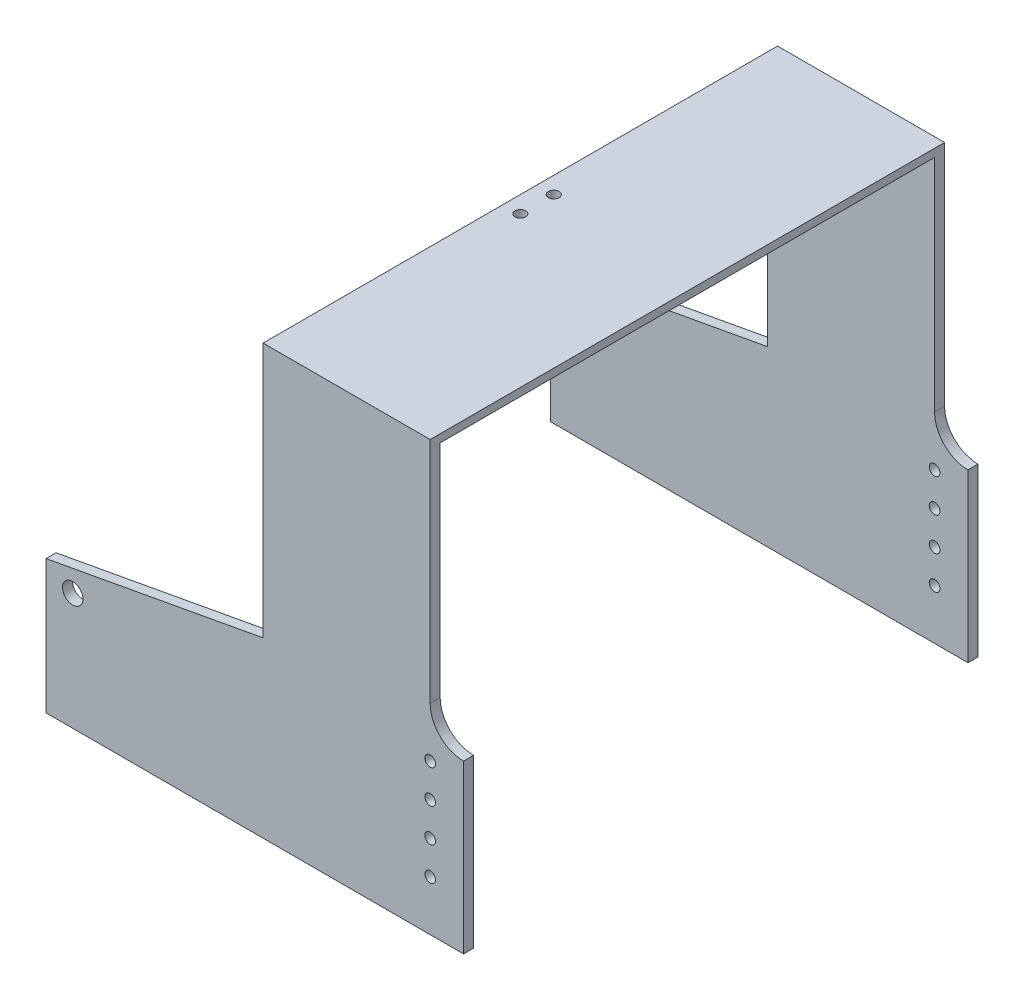
ISO-10303-21;
HEADER;
FILE_DESCRIPTION(('STEP AP214'),'2;1');
FILE_NAME('part.step','',(''),(''),'','','');
FILE_SCHEMA(('AUTOMOTIVE_DESIGN { 1 0 10303 214 1 1 1 1 }'));
ENDSEC;
DATA;
#1=APPLICATION_CONTEXT('core data for automotive mechanical design processes');
#2=APPLICATION_PROTOCOL_DEFINITION('international standard','automotive_design',2000,#1);
#3=PRODUCT_CONTEXT('',#1,'mechanical');
#4=PRODUCT('Part','Part','',(#3));
#5=PRODUCT_RELATED_PRODUCT_CATEGORY('part','',(#4));
#6=PRODUCT_DEFINITION_FORMATION('','',#4);
#7=PRODUCT_DEFINITION_CONTEXT('part definition',#1,'design');
#8=PRODUCT_DEFINITION('design','',#6,#7);
#9=PRODUCT_DEFINITION_SHAPE('','',#8);
#10=(LENGTH_UNIT() NAMED_UNIT(*) SI_UNIT(.MILLI.,.METRE.));
#11=(NAMED_UNIT(*) PLANE_ANGLE_UNIT() SI_UNIT($,.RADIAN.));
#12=(NAMED_UNIT(*) SI_UNIT($,.STERADIAN.) SOLID_ANGLE_UNIT());
#13=UNCERTAINTY_MEASURE_WITH_UNIT(LENGTH_MEASURE(1.E-05),#10,'distance_accuracy_value','');
#14=(GEOMETRIC_REPRESENTATION_CONTEXT(3) GLOBAL_UNCERTAINTY_ASSIGNED_CONTEXT((#13)) GLOBAL_UNIT_ASSIGNED_CONTEXT((#10,
#11,#12)) REPRESENTATION_CONTEXT('',''));
#15=CARTESIAN_POINT('',(0.,0.,0.));
#16=DIRECTION('',(0.,0.,1.));
#17=DIRECTION('',(1.,0.,0.));
#18=AXIS2_PLACEMENT_3D('',#15,#16,#17);
#19=CARTESIAN_POINT('',(-121.707383513561,14.5764027473865,154.));
#20=DIRECTION('',(0.180649896804306,-0.983547464428938,0.));
#21=DIRECTION('',(0.983547464428938,0.180649896804306,0.));
#22=AXIS2_PLACEMENT_3D('',#19,#20,#21);
#23=PLANE('',#22);
#24=DIRECTION('',(0.,0.,-1.));
#25=VECTOR('',#24,1.);
#26=CARTESIAN_POINT('',(-56.7073835135608,26.5150673436066,154.));
#27=LINE('',#26,#25);
#28=CARTESIAN_POINT('',(-56.7073835135608,26.5150673436066,154.));
#29=VERTEX_POINT('',#28);
#30=CARTESIAN_POINT('',(-56.7073835135608,26.5150673436066,151.));
#31=VERTEX_POINT('',#30);
#32=EDGE_CURVE('E191',#29,#31,#27,.T.);
#33=ORIENTED_EDGE('',*,*,#32,.T.);
#34=DIRECTION('',(-0.983547464428938,-0.180649896804306,0.));
#35=VECTOR('',#34,1.);
#36=CARTESIAN_POINT('',(-121.707383513561,14.5764027473865,151.));
#37=LINE('',#36,#35);
#38=CARTESIAN_POINT('',(-121.707383513561,14.5764027473865,151.));
#39=VERTEX_POINT('',#38);
#40=EDGE_CURVE('E312',#31,#39,#37,.T.);
#41=ORIENTED_EDGE('',*,*,#40,.T.);
#42=DIRECTION('',(0.,0.,-1.));
#43=VECTOR('',#42,1.);
#44=CARTESIAN_POINT('',(-121.707383513561,14.5764027473865,154.));
#45=LINE('',#44,#43);
#46=CARTESIAN_POINT('',(-121.707383513561,14.5764027473865,154.));
#47=VERTEX_POINT('',#46);
#48=EDGE_CURVE('E187',#47,#39,#45,.T.);
#49=ORIENTED_EDGE('',*,*,#48,.F.);
#50=DIRECTION('',(-0.983547464428938,-0.180649896804306,0.));
#51=VECTOR('',#50,1.);
#52=CARTESIAN_POINT('',(-121.707383513561,14.5764027473865,154.));
#53=LINE('',#52,#51);
#54=EDGE_CURVE('E269',#29,#47,#53,.T.);
#55=ORIENTED_EDGE('',*,*,#54,.F.);
#56=EDGE_LOOP('',(#33,#41,#49,#55));
#57=FACE_BOUND('',#56,.T.);
#58=ADVANCED_FACE('F40',(#57),#23,.F.);
#59=CARTESIAN_POINT('',(-121.707383513561,-25.4235972526135,154.));
#60=DIRECTION('',(1.,0.,0.));
#61=DIRECTION('',(0.,0.,-1.));
#62=AXIS2_PLACEMENT_3D('',#59,#60,#61);
#63=PLANE('',#62);
#64=ORIENTED_EDGE('',*,*,#48,.T.);
#65=DIRECTION('',(0.,-1.,0.));
#66=VECTOR('',#65,1.);
#67=CARTESIAN_POINT('',(-121.707383513561,100.576402747386,151.));
#68=LINE('',#67,#66);
#69=CARTESIAN_POINT('',(-121.707383513561,-25.4235972526135,151.));
#70=VERTEX_POINT('',#69);
#71=EDGE_CURVE('E205',#39,#70,#68,.T.);
#72=ORIENTED_EDGE('',*,*,#71,.T.);
#73=DIRECTION('',(0.,0.,-1.));
#74=VECTOR('',#73,1.);
#75=CARTESIAN_POINT('',(-121.707383513561,-25.4235972526135,154.));
#76=LINE('',#75,#74);
#77=CARTESIAN_POINT('',(-121.707383513561,-25.4235972526135,154.));
#78=VERTEX_POINT('',#77);
#79=EDGE_CURVE('E178',#78,#70,#76,.T.);
#80=ORIENTED_EDGE('',*,*,#79,.F.);
#81=DIRECTION('',(0.,-1.,0.));
#82=VECTOR('',#81,1.);
#83=CARTESIAN_POINT('',(-121.707383513561,-25.4235972526135,154.));
#84=LINE('',#83,#82);
#85=EDGE_CURVE('E267',#47,#78,#84,.T.);
#86=ORIENTED_EDGE('',*,*,#85,.F.);
#87=EDGE_LOOP('',(#64,#72,#80,#86));
#88=FACE_BOUND('',#87,.T.);
#89=ADVANCED_FACE('F398',(#88),#63,.F.);
#90=CARTESIAN_POINT('',(3.29261648643917,-25.4235972526135,154.));
#91=DIRECTION('',(0.,1.,0.));
#92=DIRECTION('',(-1.,0.,0.));
#93=AXIS2_PLACEMENT_3D('',#90,#91,#92);
#94=PLANE('',#93);
#95=ORIENTED_EDGE('',*,*,#79,.T.);
#96=DIRECTION('',(-1.,0.,0.));
#97=VECTOR('',#96,1.);
#98=CARTESIAN_POINT('',(-121.707383513561,-25.4235972526135,151.));
#99=LINE('',#98,#97);
#100=CARTESIAN_POINT('',(3.29261648643917,-25.4235972526135,151.));
#101=VERTEX_POINT('',#100);
#102=EDGE_CURVE('E171',#101,#70,#99,.T.);
#103=ORIENTED_EDGE('',*,*,#102,.F.);
#104=DIRECTION('',(0.,0.,-1.));
#105=VECTOR('',#104,1.);
#106=CARTESIAN_POINT('',(3.29261648643917,-25.4235972526135,154.));
#107=LINE('',#106,#105);
#108=CARTESIAN_POINT('',(3.29261648643917,-25.4235972526135,154.));
#109=VERTEX_POINT('',#108);
#110=EDGE_CURVE('E179',#109,#101,#107,.T.);
#111=ORIENTED_EDGE('',*,*,#110,.F.);
#112=DIRECTION('',(1.,0.,0.));
#113=VECTOR('',#112,1.);
#114=CARTESIAN_POINT('',(3.29261648643917,-25.4235972526135,154.));
#115=LINE('',#114,#113);
#116=EDGE_CURVE('E265',#78,#109,#115,.T.);
#117=ORIENTED_EDGE('',*,*,#116,.F.);
#118=EDGE_LOOP('',(#95,#103,#111,#117));
#119=FACE_BOUND('',#118,.T.);
#120=ADVANCED_FACE('F401',(#119),#94,.F.);
#121=CARTESIAN_POINT('',(3.29261648643917,24.5764027473865,154.));
#122=DIRECTION('',(-1.,0.,0.));
#123=DIRECTION('',(0.,-1.,0.));
#124=AXIS2_PLACEMENT_3D('',#121,#122,#123);
#125=PLANE('',#124);
#126=ORIENTED_EDGE('',*,*,#110,.T.);
#127=DIRECTION('',(0.,-1.,0.));
#128=VECTOR('',#127,1.);
#129=CARTESIAN_POINT('',(3.29261648643916,100.576402747386,151.));
#130=LINE('',#129,#128);
#131=CARTESIAN_POINT('',(3.29261648643917,24.5764027473865,151.));
#132=VERTEX_POINT('',#131);
#133=EDGE_CURVE('E229',#132,#101,#130,.T.);
#134=ORIENTED_EDGE('',*,*,#133,.F.);
#135=DIRECTION('',(0.,0.,-1.));
#136=VECTOR('',#135,1.);
#137=CARTESIAN_POINT('',(3.29261648643917,24.5764027473865,154.));
#138=LINE('',#137,#136);
#139=CARTESIAN_POINT('',(3.29261648643917,24.5764027473865,154.));
#140=VERTEX_POINT('',#139);
#141=EDGE_CURVE('E240',#140,#132,#138,.T.);
#142=ORIENTED_EDGE('',*,*,#141,.F.);
#143=DIRECTION('',(0.,1.,0.));
#144=VECTOR('',#143,1.);
#145=CARTESIAN_POINT('',(3.29261648643917,24.5764027473865,154.));
#146=LINE('',#145,#144);
#147=EDGE_CURVE('E244',#109,#140,#146,.T.);
#148=ORIENTED_EDGE('',*,*,#147,.F.);
#149=EDGE_LOOP('',(#126,#134,#142,#148));
#150=FACE_BOUND('',#149,.T.);
#151=ADVANCED_FACE('F238',(#150),#125,.F.);
#152=CARTESIAN_POINT('',(-6.70738351356083,-10.4235972526135,154.));
#153=DIRECTION('',(0.,0.,-1.));
#154=DIRECTION('',(-1.,0.,0.));
#155=AXIS2_PLACEMENT_3D('',#152,#153,#154);
#156=CYLINDRICAL_SURFACE('',#155,1.6);
#157=CARTESIAN_POINT('',(-6.70738351356083,-10.4235972526135,151.));
#158=DIRECTION('',(0.,0.,1.));
#159=DIRECTION('',(1.,0.,0.));
#160=AXIS2_PLACEMENT_3D('',#157,#158,#159);
#161=CIRCLE('',#160,1.6);
#162=CARTESIAN_POINT('',(-5.10738351356083,-10.4235972526135,151.));
#163=VERTEX_POINT('',#162);
#164=EDGE_CURVE('E315',#163,#163,#161,.T.);
#165=ORIENTED_EDGE('',*,*,#164,.F.);
#166=EDGE_LOOP('',(#165));
#167=FACE_BOUND('',#166,.T.);
#168=CARTESIAN_POINT('',(-6.70738351356083,-10.4235972526135,154.));
#169=DIRECTION('',(0.,0.,1.));
#170=DIRECTION('',(1.,0.,0.));
#171=AXIS2_PLACEMENT_3D('',#168,#169,#170);
#172=CIRCLE('',#171,1.6);
#173=CARTESIAN_POINT('',(-5.10738351356083,-10.4235972526135,154.));
#174=VERTEX_POINT('',#173);
#175=EDGE_CURVE('E263',#174,#174,#172,.T.);
#176=ORIENTED_EDGE('',*,*,#175,.T.);
#177=EDGE_LOOP('',(#176));
#178=FACE_BOUND('',#177,.T.);
#179=ADVANCED_FACE('F408',(#167,#178),#156,.F.);
#180=CARTESIAN_POINT('',(-6.70738351356083,-0.423597252613511,154.));
#181=DIRECTION('',(0.,0.,-1.));
#182=DIRECTION('',(-1.,0.,0.));
#183=AXIS2_PLACEMENT_3D('',#180,#181,#182);
#184=CYLINDRICAL_SURFACE('',#183,1.6);
#185=CARTESIAN_POINT('',(-6.70738351356083,-0.423597252613511,151.));
#186=DIRECTION('',(0.,0.,1.));
#187=DIRECTION('',(1.,0.,0.));
#188=AXIS2_PLACEMENT_3D('',#185,#186,#187);
#189=CIRCLE('',#188,1.6);
#190=CARTESIAN_POINT('',(-5.10738351356083,-0.423597252613511,151.));
#191=VERTEX_POINT('',#190);
#192=EDGE_CURVE('E318',#191,#191,#189,.T.);
#193=ORIENTED_EDGE('',*,*,#192,.F.);
#194=EDGE_LOOP('',(#193));
#195=FACE_BOUND('',#194,.T.);
#196=CARTESIAN_POINT('',(-6.70738351356083,-0.423597252613511,154.));
#197=DIRECTION('',(0.,0.,1.));
#198=DIRECTION('',(1.,0.,0.));
#199=AXIS2_PLACEMENT_3D('',#196,#197,#198);
#200=CIRCLE('',#199,1.6);
#201=CARTESIAN_POINT('',(-5.10738351356083,-0.423597252613511,154.));
#202=VERTEX_POINT('',#201);
#203=EDGE_CURVE('E279',#202,#202,#200,.T.);
#204=ORIENTED_EDGE('',*,*,#203,.T.);
#205=EDGE_LOOP('',(#204));
#206=FACE_BOUND('',#205,.T.);
#207=ADVANCED_FACE('F460',(#195,#206),#184,.F.);
#208=CARTESIAN_POINT('',(-6.70738351356083,9.57640274738649,154.));
#209=DIRECTION('',(0.,0.,-1.));
#210=DIRECTION('',(-1.,0.,0.));
#211=AXIS2_PLACEMENT_3D('',#208,#209,#210);
#212=CYLINDRICAL_SURFACE('',#211,1.6);
#213=CARTESIAN_POINT('',(-6.70738351356083,9.57640274738649,151.));
#214=DIRECTION('',(0.,0.,1.));
#215=DIRECTION('',(1.,0.,0.));
#216=AXIS2_PLACEMENT_3D('',#213,#214,#215);
#217=CIRCLE('',#216,1.6);
#218=CARTESIAN_POINT('',(-5.10738351356083,9.57640274738649,151.));
#219=VERTEX_POINT('',#218);
#220=EDGE_CURVE('E321',#219,#219,#217,.T.);
#221=ORIENTED_EDGE('',*,*,#220,.F.);
#222=EDGE_LOOP('',(#221));
#223=FACE_BOUND('',#222,.T.);
#224=CARTESIAN_POINT('',(-6.70738351356083,9.57640274738649,154.));
#225=DIRECTION('',(0.,0.,1.));
#226=DIRECTION('',(1.,0.,0.));
#227=AXIS2_PLACEMENT_3D('',#224,#225,#226);
#228=CIRCLE('',#227,1.6);
#229=CARTESIAN_POINT('',(-5.10738351356083,9.57640274738649,154.));
#230=VERTEX_POINT('',#229);
#231=EDGE_CURVE('E285',#230,#230,#228,.T.);
#232=ORIENTED_EDGE('',*,*,#231,.T.);
#233=EDGE_LOOP('',(#232));
#234=FACE_BOUND('',#233,.T.);
#235=ADVANCED_FACE('F465',(#223,#234),#212,.F.);
#236=CARTESIAN_POINT('',(-6.70738351356083,19.5764027473865,154.));
#237=DIRECTION('',(0.,0.,-1.));
#238=DIRECTION('',(-1.,0.,0.));
#239=AXIS2_PLACEMENT_3D('',#236,#237,#238);
#240=CYLINDRICAL_SURFACE('',#239,1.6);
#241=CARTESIAN_POINT('',(-6.70738351356083,19.5764027473865,151.));
#242=DIRECTION('',(0.,0.,1.));
#243=DIRECTION('',(1.,0.,0.));
#244=AXIS2_PLACEMENT_3D('',#241,#242,#243);
#245=CIRCLE('',#244,1.6);
#246=CARTESIAN_POINT('',(-5.10738351356083,19.5764027473865,151.));
#247=VERTEX_POINT('',#246);
#248=EDGE_CURVE('E209',#247,#247,#245,.T.);
#249=ORIENTED_EDGE('',*,*,#248,.F.);
#250=EDGE_LOOP('',(#249));
#251=FACE_BOUND('',#250,.T.);
#252=CARTESIAN_POINT('',(-6.70738351356083,19.5764027473865,154.));
#253=DIRECTION('',(0.,0.,1.));
#254=DIRECTION('',(1.,0.,0.));
#255=AXIS2_PLACEMENT_3D('',#252,#253,#254);
#256=CIRCLE('',#255,1.6);
#257=CARTESIAN_POINT('',(-5.10738351356083,19.5764027473865,154.));
#258=VERTEX_POINT('',#257);
#259=EDGE_CURVE('E291',#258,#258,#256,.T.);
#260=ORIENTED_EDGE('',*,*,#259,.T.);
#261=EDGE_LOOP('',(#260));
#262=FACE_BOUND('',#261,.T.);
#263=ADVANCED_FACE('F470',(#251,#262),#240,.F.);
#264=CARTESIAN_POINT('',(-113.707383513561,9.57640274738648,0.));
#265=DIRECTION('',(0.,0.,1.));
#266=DIRECTION('',(1.,0.,0.));
#267=AXIS2_PLACEMENT_3D('',#264,#265,#266);
#268=CYLINDRICAL_SURFACE('',#267,3.04999999999999);
#269=CARTESIAN_POINT('',(-113.707383513561,9.57640274738648,151.));
#270=DIRECTION('',(0.,0.,1.));
#271=DIRECTION('',(1.,0.,0.));
#272=AXIS2_PLACEMENT_3D('',#269,#270,#271);
#273=CIRCLE('',#272,3.04999999999999);
#274=CARTESIAN_POINT('',(-110.657383513561,9.57640274738648,151.));
#275=VERTEX_POINT('',#274);
#276=EDGE_CURVE('E206',#275,#275,#273,.F.);
#277=ORIENTED_EDGE('',*,*,#276,.T.);
#278=EDGE_LOOP('',(#277));
#279=FACE_BOUND('',#278,.T.);
#280=CARTESIAN_POINT('',(-113.707383513561,9.57640274738648,154.));
#281=DIRECTION('',(0.,0.,1.));
#282=DIRECTION('',(1.,0.,0.));
#283=AXIS2_PLACEMENT_3D('',#280,#281,#282);
#284=CIRCLE('',#283,3.04999999999999);
#285=CARTESIAN_POINT('',(-110.657383513561,9.57640274738648,154.));
#286=VERTEX_POINT('',#285);
#287=EDGE_CURVE('E300',#286,#286,#284,.T.);
#288=ORIENTED_EDGE('',*,*,#287,.T.);
#289=EDGE_LOOP('',(#288));
#290=FACE_BOUND('',#289,.T.);
#291=ADVANCED_FACE('F453',(#279,#290),#268,.F.);
#292=CARTESIAN_POINT('',(0.,0.,154.));
#293=DIRECTION('',(0.,0.,-1.));
#294=DIRECTION('',(-1.,0.,0.));
#295=AXIS2_PLACEMENT_3D('',#292,#293,#294);
#296=PLANE('',#295);
#297=ORIENTED_EDGE('',*,*,#287,.F.);
#298=EDGE_LOOP('',(#297));
#299=FACE_BOUND('',#298,.T.);
#300=ORIENTED_EDGE('',*,*,#147,.T.);
#301=CARTESIAN_POINT('',(3.29261648643916,34.5764027473865,154.));
#302=DIRECTION('',(0.,0.,-1.));
#303=DIRECTION('',(-1.,0.,0.));
#304=AXIS2_PLACEMENT_3D('',#301,#302,#303);
#305=CIRCLE('',#304,10.);
#306=CARTESIAN_POINT('',(-6.70738351356084,34.5764027473865,154.));
#307=VERTEX_POINT('',#306);
#308=EDGE_CURVE('E11',#140,#307,#305,.T.);
#309=ORIENTED_EDGE('',*,*,#308,.T.);
#310=DIRECTION('',(0.,1.,0.));
#311=VECTOR('',#310,1.);
#312=CARTESIAN_POINT('',(-6.70738351356084,102.946004207987,154.));
#313=LINE('',#312,#311);
#314=CARTESIAN_POINT('',(-6.70738351356084,102.946004207987,154.));
#315=VERTEX_POINT('',#314);
#316=EDGE_CURVE('E249',#307,#315,#313,.T.);
#317=ORIENTED_EDGE('',*,*,#316,.T.);
#318=DIRECTION('',(-1.,0.,0.));
#319=VECTOR('',#318,1.);
#320=CARTESIAN_POINT('',(-56.7073835135608,102.946004207987,154.));
#321=LINE('',#320,#319);
#322=CARTESIAN_POINT('',(-56.7073835135608,102.946004207987,154.));
#323=VERTEX_POINT('',#322);
#324=EDGE_CURVE('E273',#315,#323,#321,.T.);
#325=ORIENTED_EDGE('',*,*,#324,.T.);
#326=DIRECTION('',(0.,-1.,0.));
#327=VECTOR('',#326,1.);
#328=CARTESIAN_POINT('',(-56.7073835135608,26.5150673436066,154.));
#329=LINE('',#328,#327);
#330=EDGE_CURVE('E271',#323,#29,#329,.T.);
#331=ORIENTED_EDGE('',*,*,#330,.T.);
#332=ORIENTED_EDGE('',*,*,#54,.T.);
#333=ORIENTED_EDGE('',*,*,#85,.T.);
#334=ORIENTED_EDGE('',*,*,#116,.T.);
#335=EDGE_LOOP('',(#300,#309,#317,#325,#331,#332,#333,#334));
#336=FACE_BOUND('',#335,.T.);
#337=ORIENTED_EDGE('',*,*,#175,.F.);
#338=EDGE_LOOP('',(#337));
#339=FACE_BOUND('',#338,.T.);
#340=ORIENTED_EDGE('',*,*,#203,.F.);
#341=EDGE_LOOP('',(#340));
#342=FACE_BOUND('',#341,.T.);
#343=ORIENTED_EDGE('',*,*,#231,.F.);
#344=EDGE_LOOP('',(#343));
#345=FACE_BOUND('',#344,.T.);
#346=ORIENTED_EDGE('',*,*,#259,.F.);
#347=EDGE_LOOP('',(#346));
#348=FACE_BOUND('',#347,.T.);
#349=ADVANCED_FACE('F390',(#299,#336,#339,#342,#345,#348),#296,.F.);
#350=CARTESIAN_POINT('',(0.,0.,0.));
#351=DIRECTION('',(0.,0.,-1.));
#352=DIRECTION('',(-1.,0.,0.));
#353=AXIS2_PLACEMENT_3D('',#350,#351,#352);
#354=PLANE('',#353);
#355=CARTESIAN_POINT('',(-113.707383513561,9.57640274738648,0.));
#356=DIRECTION('',(0.,0.,1.));
#357=DIRECTION('',(1.,0.,0.));
#358=AXIS2_PLACEMENT_3D('',#355,#356,#357);
#359=CIRCLE('',#358,3.04999999999999);
#360=CARTESIAN_POINT('',(-110.657383513561,9.57640274738648,0.));
#361=VERTEX_POINT('',#360);
#362=EDGE_CURVE('E297',#361,#361,#359,.T.);
#363=ORIENTED_EDGE('',*,*,#362,.T.);
#364=EDGE_LOOP('',(#363));
#365=FACE_BOUND('',#364,.T.);
#366=CARTESIAN_POINT('',(-6.70738351356083,9.57640274738649,0.));
#367=DIRECTION('',(0.,0.,1.));
#368=DIRECTION('',(1.,0.,0.));
#369=AXIS2_PLACEMENT_3D('',#366,#367,#368);
#370=CIRCLE('',#369,1.6);
#371=CARTESIAN_POINT('',(-5.10738351356083,9.57640274738649,0.));
#372=VERTEX_POINT('',#371);
#373=EDGE_CURVE('E288',#372,#372,#370,.T.);
#374=ORIENTED_EDGE('',*,*,#373,.T.);
#375=EDGE_LOOP('',(#374));
#376=FACE_BOUND('',#375,.T.);
#377=CARTESIAN_POINT('',(-6.70738351356083,-10.4235972526135,0.));
#378=DIRECTION('',(0.,0.,1.));
#379=DIRECTION('',(1.,0.,0.));
#380=AXIS2_PLACEMENT_3D('',#377,#378,#379);
#381=CIRCLE('',#380,1.6);
#382=CARTESIAN_POINT('',(-5.10738351356083,-10.4235972526135,0.));
#383=VERTEX_POINT('',#382);
#384=EDGE_CURVE('E276',#383,#383,#381,.T.);
#385=ORIENTED_EDGE('',*,*,#384,.T.);
#386=EDGE_LOOP('',(#385));
#387=FACE_BOUND('',#386,.T.);
#388=DIRECTION('',(0.,1.,0.));
#389=VECTOR('',#388,1.);
#390=CARTESIAN_POINT('',(-6.70738351356084,102.946004207987,0.));
#391=LINE('',#390,#389);
#392=CARTESIAN_POINT('',(-6.70738351356084,34.5764027473865,0.));
#393=VERTEX_POINT('',#392);
#394=CARTESIAN_POINT('',(-6.70738351356084,102.946004207987,0.));
#395=VERTEX_POINT('',#394);
#396=EDGE_CURVE('E261',#393,#395,#391,.T.);
#397=ORIENTED_EDGE('',*,*,#396,.F.);
#398=CARTESIAN_POINT('',(3.29261648643916,34.5764027473865,0.));
#399=DIRECTION('',(0.,0.,-1.));
#400=DIRECTION('',(-1.,0.,0.));
#401=AXIS2_PLACEMENT_3D('',#398,#399,#400);
#402=CIRCLE('',#401,10.);
#403=CARTESIAN_POINT('',(3.29261648643917,24.5764027473865,0.));
#404=VERTEX_POINT('',#403);
#405=EDGE_CURVE('E61',#393,#404,#402,.F.);
#406=ORIENTED_EDGE('',*,*,#405,.T.);
#407=DIRECTION('',(0.,1.,0.));
#408=VECTOR('',#407,1.);
#409=CARTESIAN_POINT('',(3.29261648643917,24.5764027473865,0.));
#410=LINE('',#409,#408);
#411=CARTESIAN_POINT('',(3.29261648643917,-25.4235972526135,0.));
#412=VERTEX_POINT('',#411);
#413=EDGE_CURVE('E246',#412,#404,#410,.T.);
#414=ORIENTED_EDGE('',*,*,#413,.F.);
#415=DIRECTION('',(1.,0.,0.));
#416=VECTOR('',#415,1.);
#417=CARTESIAN_POINT('',(3.29261648643917,-25.4235972526135,0.));
#418=LINE('',#417,#416);
#419=CARTESIAN_POINT('',(-121.707383513561,-25.4235972526135,0.));
#420=VERTEX_POINT('',#419);
#421=EDGE_CURVE('E250',#420,#412,#418,.T.);
#422=ORIENTED_EDGE('',*,*,#421,.F.);
#423=DIRECTION('',(0.,-1.,0.));
#424=VECTOR('',#423,1.);
#425=CARTESIAN_POINT('',(-121.707383513561,-25.4235972526135,0.));
#426=LINE('',#425,#424);
#427=CARTESIAN_POINT('',(-121.707383513561,14.5764027473865,0.));
#428=VERTEX_POINT('',#427);
#429=EDGE_CURVE('E176',#428,#420,#426,.T.);
#430=ORIENTED_EDGE('',*,*,#429,.F.);
#431=DIRECTION('',(-0.983547464428938,-0.180649896804306,0.));
#432=VECTOR('',#431,1.);
#433=CARTESIAN_POINT('',(-121.707383513561,14.5764027473865,0.));
#434=LINE('',#433,#432);
#435=CARTESIAN_POINT('',(-56.7073835135608,26.5150673436066,0.));
#436=VERTEX_POINT('',#435);
#437=EDGE_CURVE('E253',#436,#428,#434,.T.);
#438=ORIENTED_EDGE('',*,*,#437,.F.);
#439=DIRECTION('',(0.,-1.,0.));
#440=VECTOR('',#439,1.);
#441=CARTESIAN_POINT('',(-56.7073835135608,26.5150673436066,0.));
#442=LINE('',#441,#440);
#443=CARTESIAN_POINT('',(-56.7073835135608,102.946004207987,0.));
#444=VERTEX_POINT('',#443);
#445=EDGE_CURVE('E256',#444,#436,#442,.T.);
#446=ORIENTED_EDGE('',*,*,#445,.F.);
#447=DIRECTION('',(-1.,0.,0.));
#448=VECTOR('',#447,1.);
#449=CARTESIAN_POINT('',(-56.7073835135608,102.946004207987,0.));
#450=LINE('',#449,#448);
#451=EDGE_CURVE('E259',#395,#444,#450,.T.);
#452=ORIENTED_EDGE('',*,*,#451,.F.);
#453=EDGE_LOOP('',(#397,#406,#414,#422,#430,#438,#446,#452));
#454=FACE_BOUND('',#453,.T.);
#455=CARTESIAN_POINT('',(-6.70738351356083,-0.423597252613511,0.));
#456=DIRECTION('',(0.,0.,1.));
#457=DIRECTION('',(1.,0.,0.));
#458=AXIS2_PLACEMENT_3D('',#455,#456,#457);
#459=CIRCLE('',#458,1.6);
#460=CARTESIAN_POINT('',(-5.10738351356083,-0.423597252613511,0.));
#461=VERTEX_POINT('',#460);
#462=EDGE_CURVE('E282',#461,#461,#459,.T.);
#463=ORIENTED_EDGE('',*,*,#462,.T.);
#464=EDGE_LOOP('',(#463));
#465=FACE_BOUND('',#464,.T.);
#466=CARTESIAN_POINT('',(-6.70738351356083,19.5764027473865,0.));
#467=DIRECTION('',(0.,0.,1.));
#468=DIRECTION('',(1.,0.,0.));
#469=AXIS2_PLACEMENT_3D('',#466,#467,#468);
#470=CIRCLE('',#469,1.6);
#471=CARTESIAN_POINT('',(-5.10738351356083,19.5764027473865,0.));
#472=VERTEX_POINT('',#471);
#473=EDGE_CURVE('E294',#472,#472,#470,.T.);
#474=ORIENTED_EDGE('',*,*,#473,.T.);
#475=EDGE_LOOP('',(#474));
#476=FACE_BOUND('',#475,.T.);
#477=ADVANCED_FACE('F381',(#365,#376,#387,#454,#465,#476),#354,.T.);
#478=CARTESIAN_POINT('',(-6.70738351356084,102.946004207987,154.));
#479=DIRECTION('',(-1.,0.,0.));
#480=DIRECTION('',(0.,-1.,0.));
#481=AXIS2_PLACEMENT_3D('',#478,#479,#480);
#482=PLANE('',#481);
#483=DIRECTION('',(0.,-1.,0.));
#484=VECTOR('',#483,1.);
#485=CARTESIAN_POINT('',(-6.70738351356084,102.946004207987,3.));
#486=LINE('',#485,#484);
#487=CARTESIAN_POINT('',(-6.70738351356084,100.576402747386,3.));
#488=VERTEX_POINT('',#487);
#489=CARTESIAN_POINT('',(-6.70738351356084,34.5764027473865,3.));
#490=VERTEX_POINT('',#489);
#491=EDGE_CURVE('E210',#488,#490,#486,.T.);
#492=ORIENTED_EDGE('',*,*,#491,.T.);
#493=DIRECTION('',(0.,0.,-1.));
#494=VECTOR('',#493,1.);
#495=CARTESIAN_POINT('',(-6.70738351356084,34.5764027473865,0.));
#496=LINE('',#495,#494);
#497=EDGE_CURVE('E221',#490,#393,#496,.T.);
#498=ORIENTED_EDGE('',*,*,#497,.T.);
#499=ORIENTED_EDGE('',*,*,#396,.T.);
#500=DIRECTION('',(0.,0.,-1.));
#501=VECTOR('',#500,1.);
#502=CARTESIAN_POINT('',(-6.70738351356084,102.946004207987,154.));
#503=LINE('',#502,#501);
#504=EDGE_CURVE('E197',#315,#395,#503,.T.);
#505=ORIENTED_EDGE('',*,*,#504,.F.);
#506=ORIENTED_EDGE('',*,*,#316,.F.);
#507=DIRECTION('',(0.,0.,-1.));
#508=VECTOR('',#507,1.);
#509=CARTESIAN_POINT('',(-6.70738351356084,34.5764027473865,151.));
#510=LINE('',#509,#508);
#511=CARTESIAN_POINT('',(-6.70738351356084,34.5764027473865,151.));
#512=VERTEX_POINT('',#511);
#513=EDGE_CURVE('E212',#307,#512,#510,.T.);
#514=ORIENTED_EDGE('',*,*,#513,.T.);
#515=DIRECTION('',(0.,1.,0.));
#516=VECTOR('',#515,1.);
#517=CARTESIAN_POINT('',(-6.70738351356084,102.946004207987,151.));
#518=LINE('',#517,#516);
#519=CARTESIAN_POINT('',(-6.70738351356084,100.576402747386,151.));
#520=VERTEX_POINT('',#519);
#521=EDGE_CURVE('E232',#512,#520,#518,.T.);
#522=ORIENTED_EDGE('',*,*,#521,.T.);
#523=DIRECTION('',(0.,0.,1.));
#524=VECTOR('',#523,1.);
#525=CARTESIAN_POINT('',(-6.70738351356084,100.576402747386,154.));
#526=LINE('',#525,#524);
#527=EDGE_CURVE('E303',#488,#520,#526,.T.);
#528=ORIENTED_EDGE('',*,*,#527,.F.);
#529=EDGE_LOOP('',(#492,#498,#499,#505,#506,#514,#522,#528));
#530=FACE_BOUND('',#529,.T.);
#531=ADVANCED_FACE('F364',(#530),#482,.F.);
#532=CARTESIAN_POINT('',(-56.7073835135608,102.946004207987,154.));
#533=DIRECTION('',(0.,-1.,0.));
#534=DIRECTION('',(1.,0.,0.));
#535=AXIS2_PLACEMENT_3D('',#532,#533,#534);
#536=PLANE('',#535);
#537=CARTESIAN_POINT('',(-51.7073835135608,102.946004207987,72.));
#538=DIRECTION('',(0.,1.,0.));
#539=DIRECTION('',(0.,0.,1.));
#540=AXIS2_PLACEMENT_3D('',#537,#538,#539);
#541=CIRCLE('',#540,1.6);
#542=CARTESIAN_POINT('',(-51.7073835135608,102.946004207987,73.6));
#543=VERTEX_POINT('',#542);
#544=EDGE_CURVE('E216',#543,#543,#541,.T.);
#545=ORIENTED_EDGE('',*,*,#544,.F.);
#546=EDGE_LOOP('',(#545));
#547=FACE_BOUND('',#546,.T.);
#548=CARTESIAN_POINT('',(-51.7073835135608,102.946004207987,82.));
#549=DIRECTION('',(0.,1.,0.));
#550=DIRECTION('',(0.,0.,1.));
#551=AXIS2_PLACEMENT_3D('',#548,#549,#550);
#552=CIRCLE('',#551,1.6);
#553=CARTESIAN_POINT('',(-51.7073835135608,102.946004207987,83.6));
#554=VERTEX_POINT('',#553);
#555=EDGE_CURVE('E352',#554,#554,#552,.T.);
#556=ORIENTED_EDGE('',*,*,#555,.F.);
#557=EDGE_LOOP('',(#556));
#558=FACE_BOUND('',#557,.T.);
#559=ORIENTED_EDGE('',*,*,#451,.T.);
#560=DIRECTION('',(0.,0.,-1.));
#561=VECTOR('',#560,1.);
#562=CARTESIAN_POINT('',(-56.7073835135608,102.946004207987,154.));
#563=LINE('',#562,#561);
#564=EDGE_CURVE('E194',#323,#444,#563,.T.);
#565=ORIENTED_EDGE('',*,*,#564,.F.);
#566=ORIENTED_EDGE('',*,*,#324,.F.);
#567=ORIENTED_EDGE('',*,*,#504,.T.);
#568=EDGE_LOOP('',(#559,#565,#566,#567));
#569=FACE_BOUND('',#568,.T.);
#570=ADVANCED_FACE('F360',(#547,#558,#569),#536,.F.);
#571=CARTESIAN_POINT('',(-56.7073835135608,26.5150673436066,154.));
#572=DIRECTION('',(1.,0.,0.));
#573=DIRECTION('',(0.,0.,-1.));
#574=AXIS2_PLACEMENT_3D('',#571,#572,#573);
#575=PLANE('',#574);
#576=DIRECTION('',(0.,0.,-1.));
#577=VECTOR('',#576,1.);
#578=CARTESIAN_POINT('',(-56.7073835135608,100.576402747386,154.));
#579=LINE('',#578,#577);
#580=CARTESIAN_POINT('',(-56.7073835135608,100.576402747386,151.));
#581=VERTEX_POINT('',#580);
#582=CARTESIAN_POINT('',(-56.7073835135608,100.576402747386,3.));
#583=VERTEX_POINT('',#582);
#584=EDGE_CURVE('E200',#581,#583,#579,.T.);
#585=ORIENTED_EDGE('',*,*,#584,.F.);
#586=DIRECTION('',(0.,-1.,0.));
#587=VECTOR('',#586,1.);
#588=CARTESIAN_POINT('',(-56.7073835135608,26.5150673436066,151.));
#589=LINE('',#588,#587);
#590=EDGE_CURVE('E309',#581,#31,#589,.T.);
#591=ORIENTED_EDGE('',*,*,#590,.T.);
#592=ORIENTED_EDGE('',*,*,#32,.F.);
#593=ORIENTED_EDGE('',*,*,#330,.F.);
#594=ORIENTED_EDGE('',*,*,#564,.T.);
#595=ORIENTED_EDGE('',*,*,#445,.T.);
#596=CARTESIAN_POINT('',(-56.7073835135608,26.5150673436066,3.));
#597=VERTEX_POINT('',#596);
#598=EDGE_CURVE('E190',#597,#436,#27,.T.);
#599=ORIENTED_EDGE('',*,*,#598,.F.);
#600=DIRECTION('',(0.,1.,0.));
#601=VECTOR('',#600,1.);
#602=CARTESIAN_POINT('',(-56.7073835135608,26.5150673436066,3.));
#603=LINE('',#602,#601);
#604=EDGE_CURVE('E328',#597,#583,#603,.T.);
#605=ORIENTED_EDGE('',*,*,#604,.T.);
#606=EDGE_LOOP('',(#585,#591,#592,#593,#594,#595,#599,#605));
#607=FACE_BOUND('',#606,.T.);
#608=ADVANCED_FACE('F363',(#607),#575,.F.);
#609=CARTESIAN_POINT('',(-121.707383513561,14.5764027473865,3.));
#610=VERTEX_POINT('',#609);
#611=EDGE_CURVE('E182',#610,#428,#45,.T.);
#612=ORIENTED_EDGE('',*,*,#611,.F.);
#613=DIRECTION('',(0.983547464428938,0.180649896804306,0.));
#614=VECTOR('',#613,1.);
#615=CARTESIAN_POINT('',(-121.707383513561,14.5764027473865,3.));
#616=LINE('',#615,#614);
#617=EDGE_CURVE('E157',#610,#597,#616,.T.);
#618=ORIENTED_EDGE('',*,*,#617,.T.);
#619=ORIENTED_EDGE('',*,*,#598,.T.);
#620=ORIENTED_EDGE('',*,*,#437,.T.);
#621=EDGE_LOOP('',(#612,#618,#619,#620));
#622=FACE_BOUND('',#621,.T.);
#623=ADVANCED_FACE('F384',(#622),#23,.F.);
#624=CARTESIAN_POINT('',(-121.707383513561,-25.4235972526135,3.));
#625=VERTEX_POINT('',#624);
#626=EDGE_CURVE('E168',#625,#420,#76,.T.);
#627=ORIENTED_EDGE('',*,*,#626,.F.);
#628=DIRECTION('',(0.,-1.,0.));
#629=VECTOR('',#628,1.);
#630=CARTESIAN_POINT('',(-121.707383513561,100.576402747386,3.));
#631=LINE('',#630,#629);
#632=EDGE_CURVE('E151',#610,#625,#631,.T.);
#633=ORIENTED_EDGE('',*,*,#632,.F.);
#634=ORIENTED_EDGE('',*,*,#611,.T.);
#635=ORIENTED_EDGE('',*,*,#429,.T.);
#636=EDGE_LOOP('',(#627,#633,#634,#635));
#637=FACE_BOUND('',#636,.T.);
#638=ADVANCED_FACE('F174',(#637),#63,.F.);
#639=CARTESIAN_POINT('',(3.29261648643917,-25.4235972526135,3.));
#640=VERTEX_POINT('',#639);
#641=EDGE_CURVE('E170',#640,#412,#107,.T.);
#642=ORIENTED_EDGE('',*,*,#641,.F.);
#643=DIRECTION('',(1.,0.,0.));
#644=VECTOR('',#643,1.);
#645=CARTESIAN_POINT('',(-121.707383513561,-25.4235972526135,3.));
#646=LINE('',#645,#644);
#647=EDGE_CURVE('E154',#625,#640,#646,.T.);
#648=ORIENTED_EDGE('',*,*,#647,.F.);
#649=ORIENTED_EDGE('',*,*,#626,.T.);
#650=ORIENTED_EDGE('',*,*,#421,.T.);
#651=EDGE_LOOP('',(#642,#648,#649,#650));
#652=FACE_BOUND('',#651,.T.);
#653=ADVANCED_FACE('F166',(#652),#94,.F.);
#654=CARTESIAN_POINT('',(3.29261648643917,24.5764027473865,3.));
#655=VERTEX_POINT('',#654);
#656=EDGE_CURVE('E243',#655,#404,#138,.T.);
#657=ORIENTED_EDGE('',*,*,#656,.F.);
#658=DIRECTION('',(0.,-1.,0.));
#659=VECTOR('',#658,1.);
#660=CARTESIAN_POINT('',(3.29261648643916,100.576402747386,3.));
#661=LINE('',#660,#659);
#662=EDGE_CURVE('E161',#655,#640,#661,.T.);
#663=ORIENTED_EDGE('',*,*,#662,.T.);
#664=ORIENTED_EDGE('',*,*,#641,.T.);
#665=ORIENTED_EDGE('',*,*,#413,.T.);
#666=EDGE_LOOP('',(#657,#663,#664,#665));
#667=FACE_BOUND('',#666,.T.);
#668=ADVANCED_FACE('F410',(#667),#125,.F.);
#669=CARTESIAN_POINT('',(-6.70738351356083,-10.4235972526135,3.));
#670=DIRECTION('',(0.,0.,-1.));
#671=DIRECTION('',(-1.,0.,0.));
#672=AXIS2_PLACEMENT_3D('',#669,#670,#671);
#673=CIRCLE('',#672,1.6);
#674=CARTESIAN_POINT('',(-8.30738351356083,-10.4235972526135,3.));
#675=VERTEX_POINT('',#674);
#676=EDGE_CURVE('E332',#675,#675,#673,.T.);
#677=ORIENTED_EDGE('',*,*,#676,.F.);
#678=EDGE_LOOP('',(#677));
#679=FACE_BOUND('',#678,.T.);
#680=ORIENTED_EDGE('',*,*,#384,.F.);
#681=EDGE_LOOP('',(#680));
#682=FACE_BOUND('',#681,.T.);
#683=ADVANCED_FACE('F441',(#679,#682),#156,.F.);
#684=CARTESIAN_POINT('',(-6.70738351356083,-0.423597252613511,3.));
#685=DIRECTION('',(0.,0.,-1.));
#686=DIRECTION('',(-1.,0.,0.));
#687=AXIS2_PLACEMENT_3D('',#684,#685,#686);
#688=CIRCLE('',#687,1.6);
#689=CARTESIAN_POINT('',(-8.30738351356083,-0.423597252613511,3.));
#690=VERTEX_POINT('',#689);
#691=EDGE_CURVE('E335',#690,#690,#688,.T.);
#692=ORIENTED_EDGE('',*,*,#691,.F.);
#693=EDGE_LOOP('',(#692));
#694=FACE_BOUND('',#693,.T.);
#695=ORIENTED_EDGE('',*,*,#462,.F.);
#696=EDGE_LOOP('',(#695));
#697=FACE_BOUND('',#696,.T.);
#698=ADVANCED_FACE('F445',(#694,#697),#184,.F.);
#699=CARTESIAN_POINT('',(-6.70738351356083,9.57640274738649,3.));
#700=DIRECTION('',(0.,0.,-1.));
#701=DIRECTION('',(-1.,0.,0.));
#702=AXIS2_PLACEMENT_3D('',#699,#700,#701);
#703=CIRCLE('',#702,1.6);
#704=CARTESIAN_POINT('',(-8.30738351356083,9.57640274738649,3.));
#705=VERTEX_POINT('',#704);
#706=EDGE_CURVE('E338',#705,#705,#703,.T.);
#707=ORIENTED_EDGE('',*,*,#706,.F.);
#708=EDGE_LOOP('',(#707));
#709=FACE_BOUND('',#708,.T.);
#710=ORIENTED_EDGE('',*,*,#373,.F.);
#711=EDGE_LOOP('',(#710));
#712=FACE_BOUND('',#711,.T.);
#713=ADVANCED_FACE('F458',(#709,#712),#212,.F.);
#714=CARTESIAN_POINT('',(-6.70738351356083,19.5764027473865,3.));
#715=DIRECTION('',(0.,0.,-1.));
#716=DIRECTION('',(-1.,0.,0.));
#717=AXIS2_PLACEMENT_3D('',#714,#715,#716);
#718=CIRCLE('',#717,1.6);
#719=CARTESIAN_POINT('',(-8.30738351356083,19.5764027473865,3.));
#720=VERTEX_POINT('',#719);
#721=EDGE_CURVE('E204',#720,#720,#718,.T.);
#722=ORIENTED_EDGE('',*,*,#721,.F.);
#723=EDGE_LOOP('',(#722));
#724=FACE_BOUND('',#723,.T.);
#725=ORIENTED_EDGE('',*,*,#473,.F.);
#726=EDGE_LOOP('',(#725));
#727=FACE_BOUND('',#726,.T.);
#728=ADVANCED_FACE('F463',(#724,#727),#240,.F.);
#729=CARTESIAN_POINT('',(-113.707383513561,9.57640274738648,3.));
#730=DIRECTION('',(0.,0.,-1.));
#731=DIRECTION('',(-1.,0.,0.));
#732=AXIS2_PLACEMENT_3D('',#729,#730,#731);
#733=CIRCLE('',#732,3.04999999999999);
#734=CARTESIAN_POINT('',(-116.757383513561,9.57640274738648,3.));
#735=VERTEX_POINT('',#734);
#736=EDGE_CURVE('E201',#735,#735,#733,.F.);
#737=ORIENTED_EDGE('',*,*,#736,.T.);
#738=EDGE_LOOP('',(#737));
#739=FACE_BOUND('',#738,.T.);
#740=ORIENTED_EDGE('',*,*,#362,.F.);
#741=EDGE_LOOP('',(#740));
#742=FACE_BOUND('',#741,.T.);
#743=ADVANCED_FACE('F468',(#739,#742),#268,.F.);
#744=CARTESIAN_POINT('',(0.,100.576402747386,0.));
#745=DIRECTION('',(0.,-1.,0.));
#746=DIRECTION('',(1.,0.,0.));
#747=AXIS2_PLACEMENT_3D('',#744,#745,#746);
#748=PLANE('',#747);
#749=CARTESIAN_POINT('',(-51.7073835135608,100.576402747386,72.));
#750=DIRECTION('',(0.,-1.,0.));
#751=DIRECTION('',(1.,0.,0.));
#752=AXIS2_PLACEMENT_3D('',#749,#750,#751);
#753=CIRCLE('',#752,1.6);
#754=CARTESIAN_POINT('',(-50.1073835135609,100.576402747386,72.));
#755=VERTEX_POINT('',#754);
#756=EDGE_CURVE('E172',#755,#755,#753,.T.);
#757=ORIENTED_EDGE('',*,*,#756,.F.);
#758=EDGE_LOOP('',(#757));
#759=FACE_BOUND('',#758,.T.);
#760=CARTESIAN_POINT('',(-51.7073835135608,100.576402747386,82.));
#761=DIRECTION('',(0.,-1.,0.));
#762=DIRECTION('',(1.,0.,0.));
#763=AXIS2_PLACEMENT_3D('',#760,#761,#762);
#764=CIRCLE('',#763,1.6);
#765=CARTESIAN_POINT('',(-50.1073835135609,100.576402747386,82.));
#766=VERTEX_POINT('',#765);
#767=EDGE_CURVE('E213',#766,#766,#764,.T.);
#768=ORIENTED_EDGE('',*,*,#767,.F.);
#769=EDGE_LOOP('',(#768));
#770=FACE_BOUND('',#769,.T.);
#771=ORIENTED_EDGE('',*,*,#527,.T.);
#772=DIRECTION('',(-1.,0.,0.));
#773=VECTOR('',#772,1.);
#774=CARTESIAN_POINT('',(-121.707383513561,100.576402747386,151.));
#775=LINE('',#774,#773);
#776=EDGE_CURVE('E162',#520,#581,#775,.T.);
#777=ORIENTED_EDGE('',*,*,#776,.T.);
#778=ORIENTED_EDGE('',*,*,#584,.T.);
#779=DIRECTION('',(1.,0.,0.));
#780=VECTOR('',#779,1.);
#781=CARTESIAN_POINT('',(-121.707383513561,100.576402747386,3.));
#782=LINE('',#781,#780);
#783=EDGE_CURVE('E346',#583,#488,#782,.T.);
#784=ORIENTED_EDGE('',*,*,#783,.T.);
#785=EDGE_LOOP('',(#771,#777,#778,#784));
#786=FACE_BOUND('',#785,.T.);
#787=ADVANCED_FACE('F388',(#759,#770,#786),#748,.T.);
#788=CARTESIAN_POINT('',(-121.707383513561,100.576402747386,151.));
#789=DIRECTION('',(0.,0.,1.));
#790=DIRECTION('',(1.,0.,0.));
#791=AXIS2_PLACEMENT_3D('',#788,#789,#790);
#792=PLANE('',#791);
#793=ORIENTED_EDGE('',*,*,#164,.T.);
#794=EDGE_LOOP('',(#793));
#795=FACE_BOUND('',#794,.T.);
#796=ORIENTED_EDGE('',*,*,#192,.T.);
#797=EDGE_LOOP('',(#796));
#798=FACE_BOUND('',#797,.T.);
#799=ORIENTED_EDGE('',*,*,#220,.T.);
#800=EDGE_LOOP('',(#799));
#801=FACE_BOUND('',#800,.T.);
#802=ORIENTED_EDGE('',*,*,#248,.T.);
#803=EDGE_LOOP('',(#802));
#804=FACE_BOUND('',#803,.T.);
#805=ORIENTED_EDGE('',*,*,#276,.F.);
#806=EDGE_LOOP('',(#805));
#807=FACE_BOUND('',#806,.T.);
#808=ORIENTED_EDGE('',*,*,#133,.T.);
#809=ORIENTED_EDGE('',*,*,#102,.T.);
#810=ORIENTED_EDGE('',*,*,#71,.F.);
#811=ORIENTED_EDGE('',*,*,#40,.F.);
#812=ORIENTED_EDGE('',*,*,#590,.F.);
#813=ORIENTED_EDGE('',*,*,#776,.F.);
#814=ORIENTED_EDGE('',*,*,#521,.F.);
#815=CARTESIAN_POINT('',(3.29261648643916,34.5764027473865,151.));
#816=DIRECTION('',(0.,0.,1.));
#817=DIRECTION('',(1.,0.,0.));
#818=AXIS2_PLACEMENT_3D('',#815,#816,#817);
#819=CIRCLE('',#818,10.);
#820=EDGE_CURVE('E48',#512,#132,#819,.T.);
#821=ORIENTED_EDGE('',*,*,#820,.T.);
#822=EDGE_LOOP('',(#808,#809,#810,#811,#812,#813,#814,#821));
#823=FACE_BOUND('',#822,.T.);
#824=ADVANCED_FACE('F228',(#795,#798,#801,#804,#807,#823),#792,.F.);
#825=CARTESIAN_POINT('',(-121.707383513561,100.576402747386,3.));
#826=DIRECTION('',(0.,0.,-1.));
#827=DIRECTION('',(-1.,0.,0.));
#828=AXIS2_PLACEMENT_3D('',#825,#826,#827);
#829=PLANE('',#828);
#830=ORIENTED_EDGE('',*,*,#676,.T.);
#831=EDGE_LOOP('',(#830));
#832=FACE_BOUND('',#831,.T.);
#833=ORIENTED_EDGE('',*,*,#691,.T.);
#834=EDGE_LOOP('',(#833));
#835=FACE_BOUND('',#834,.T.);
#836=ORIENTED_EDGE('',*,*,#706,.T.);
#837=EDGE_LOOP('',(#836));
#838=FACE_BOUND('',#837,.T.);
#839=ORIENTED_EDGE('',*,*,#721,.T.);
#840=EDGE_LOOP('',(#839));
#841=FACE_BOUND('',#840,.T.);
#842=ORIENTED_EDGE('',*,*,#736,.F.);
#843=EDGE_LOOP('',(#842));
#844=FACE_BOUND('',#843,.T.);
#845=ORIENTED_EDGE('',*,*,#491,.F.);
#846=ORIENTED_EDGE('',*,*,#783,.F.);
#847=ORIENTED_EDGE('',*,*,#604,.F.);
#848=ORIENTED_EDGE('',*,*,#617,.F.);
#849=ORIENTED_EDGE('',*,*,#632,.T.);
#850=ORIENTED_EDGE('',*,*,#647,.T.);
#851=ORIENTED_EDGE('',*,*,#662,.F.);
#852=CARTESIAN_POINT('',(3.29261648643916,34.5764027473865,3.));
#853=DIRECTION('',(0.,0.,-1.));
#854=DIRECTION('',(-1.,0.,0.));
#855=AXIS2_PLACEMENT_3D('',#852,#853,#854);
#856=CIRCLE('',#855,10.);
#857=EDGE_CURVE('E224',#655,#490,#856,.T.);
#858=ORIENTED_EDGE('',*,*,#857,.T.);
#859=EDGE_LOOP('',(#845,#846,#847,#848,#849,#850,#851,#858));
#860=FACE_BOUND('',#859,.T.);
#861=ADVANCED_FACE('F153',(#832,#835,#838,#841,#844,#860),#829,.F.);
#862=CARTESIAN_POINT('',(-51.7073835135608,-16.0539957920127,82.));
#863=DIRECTION('',(0.,1.,0.));
#864=DIRECTION('',(0.,0.,1.));
#865=AXIS2_PLACEMENT_3D('',#862,#863,#864);
#866=CYLINDRICAL_SURFACE('',#865,1.6);
#867=ORIENTED_EDGE('',*,*,#767,.T.);
#868=EDGE_LOOP('',(#867));
#869=FACE_BOUND('',#868,.T.);
#870=ORIENTED_EDGE('',*,*,#555,.T.);
#871=EDGE_LOOP('',(#870));
#872=FACE_BOUND('',#871,.T.);
#873=ADVANCED_FACE('F433',(#869,#872),#866,.F.);
#874=CARTESIAN_POINT('',(-51.7073835135608,-16.0539957920127,72.));
#875=DIRECTION('',(0.,1.,0.));
#876=DIRECTION('',(0.,0.,1.));
#877=AXIS2_PLACEMENT_3D('',#874,#875,#876);
#878=CYLINDRICAL_SURFACE('',#877,1.6);
#879=ORIENTED_EDGE('',*,*,#756,.T.);
#880=EDGE_LOOP('',(#879));
#881=FACE_BOUND('',#880,.T.);
#882=ORIENTED_EDGE('',*,*,#544,.T.);
#883=EDGE_LOOP('',(#882));
#884=FACE_BOUND('',#883,.T.);
#885=ADVANCED_FACE('F358',(#881,#884),#878,.F.);
#886=CARTESIAN_POINT('',(3.29261648643916,34.5764027473865,154.));
#887=DIRECTION('',(0.,0.,1.));
#888=DIRECTION('',(1.,0.,0.));
#889=AXIS2_PLACEMENT_3D('',#886,#887,#888);
#890=CYLINDRICAL_SURFACE('',#889,10.);
#891=ORIENTED_EDGE('',*,*,#857,.F.);
#892=ORIENTED_EDGE('',*,*,#656,.T.);
#893=ORIENTED_EDGE('',*,*,#405,.F.);
#894=ORIENTED_EDGE('',*,*,#497,.F.);
#895=EDGE_LOOP('',(#891,#892,#893,#894));
#896=FACE_BOUND('',#895,.T.);
#897=ADVANCED_FACE('F427',(#896),#890,.F.);
#898=CARTESIAN_POINT('',(3.29261648643916,34.5764027473865,154.));
#899=DIRECTION('',(0.,0.,1.));
#900=DIRECTION('',(1.,0.,0.));
#901=AXIS2_PLACEMENT_3D('',#898,#899,#900);
#902=CYLINDRICAL_SURFACE('',#901,10.);
#903=ORIENTED_EDGE('',*,*,#308,.F.);
#904=ORIENTED_EDGE('',*,*,#141,.T.);
#905=ORIENTED_EDGE('',*,*,#820,.F.);
#906=ORIENTED_EDGE('',*,*,#513,.F.);
#907=EDGE_LOOP('',(#903,#904,#905,#906));
#908=FACE_BOUND('',#907,.T.);
#909=ADVANCED_FACE('F42',(#908),#902,.F.);
#910=CLOSED_SHELL('',(#58,#89,#120,#151,#179,#207,#235,#263,#291,#349,#477,#531,#570,#608,#623,
#638,#653,#668,#683,#698,#713,#728,#743,#787,#824,#861,#873,#885,#897,#909));
#911=MANIFOLD_SOLID_BREP('B2',#910);
#912=ADVANCED_BREP_SHAPE_REPRESENTATION('',(#18,#911),#14);
#913=SHAPE_DEFINITION_REPRESENTATION(#9,#912);
ENDSEC;
END-ISO-10303-21;
